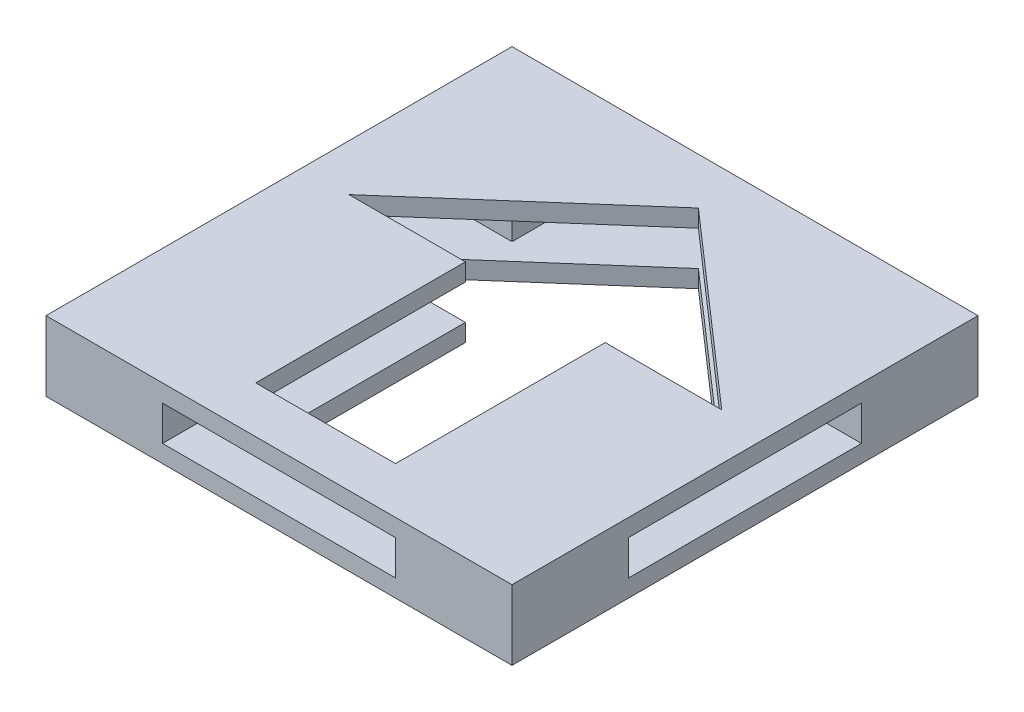
ISO-10303-21;
HEADER;
FILE_DESCRIPTION(('STEP AP214'),'2;1');
FILE_NAME('part.step','',(''),(''),'','','');
FILE_SCHEMA(('AUTOMOTIVE_DESIGN { 1 0 10303 214 1 1 1 1 }'));
ENDSEC;
DATA;
#1=APPLICATION_CONTEXT('core data for automotive mechanical design processes');
#2=APPLICATION_PROTOCOL_DEFINITION('international standard','automotive_design',2000,#1);
#3=PRODUCT_CONTEXT('',#1,'mechanical');
#4=PRODUCT('Part','Part','',(#3));
#5=PRODUCT_RELATED_PRODUCT_CATEGORY('part','',(#4));
#6=PRODUCT_DEFINITION_FORMATION('','',#4);
#7=PRODUCT_DEFINITION_CONTEXT('part definition',#1,'design');
#8=PRODUCT_DEFINITION('design','',#6,#7);
#9=PRODUCT_DEFINITION_SHAPE('','',#8);
#10=(LENGTH_UNIT() NAMED_UNIT(*) SI_UNIT(.MILLI.,.METRE.));
#11=(NAMED_UNIT(*) PLANE_ANGLE_UNIT() SI_UNIT($,.RADIAN.));
#12=(NAMED_UNIT(*) SI_UNIT($,.STERADIAN.) SOLID_ANGLE_UNIT());
#13=UNCERTAINTY_MEASURE_WITH_UNIT(LENGTH_MEASURE(1.E-05),#10,'distance_accuracy_value','');
#14=(GEOMETRIC_REPRESENTATION_CONTEXT(3) GLOBAL_UNCERTAINTY_ASSIGNED_CONTEXT((#13)) GLOBAL_UNIT_ASSIGNED_CONTEXT((#10,
#11,#12)) REPRESENTATION_CONTEXT('',''));
#15=CARTESIAN_POINT('',(0.,0.,0.));
#16=DIRECTION('',(0.,0.,1.));
#17=DIRECTION('',(1.,0.,0.));
#18=AXIS2_PLACEMENT_3D('',#15,#16,#17);
#19=CARTESIAN_POINT('',(3.,3.,-0.999999999999998));
#20=DIRECTION('',(0.,0.,-1.));
#21=DIRECTION('',(-1.,0.,0.));
#22=AXIS2_PLACEMENT_3D('',#19,#20,#21);
#23=PLANE('',#22);
#24=DIRECTION('',(0.,-1.,0.));
#25=VECTOR('',#24,1.);
#26=CARTESIAN_POINT('',(8.,3.,-0.999999999999998));
#27=LINE('',#26,#25);
#28=CARTESIAN_POINT('',(8.,3.,-0.999999999999998));
#29=VERTEX_POINT('',#28);
#30=CARTESIAN_POINT('',(8.,2.25,-0.999999999999998));
#31=VERTEX_POINT('',#30);
#32=EDGE_CURVE('E466',#29,#31,#27,.T.);
#33=ORIENTED_EDGE('',*,*,#32,.T.);
#34=DIRECTION('',(1.,0.,0.));
#35=VECTOR('',#34,1.);
#36=CARTESIAN_POINT('',(3.,2.25,-0.999999999999998));
#37=LINE('',#36,#35);
#38=CARTESIAN_POINT('',(3.,2.25,-0.999999999999999));
#39=VERTEX_POINT('',#38);
#40=EDGE_CURVE('E380',#39,#31,#37,.T.);
#41=ORIENTED_EDGE('',*,*,#40,.F.);
#42=DIRECTION('',(0.,-1.,0.));
#43=VECTOR('',#42,1.);
#44=CARTESIAN_POINT('',(3.,3.,-0.999999999999998));
#45=LINE('',#44,#43);
#46=CARTESIAN_POINT('',(3.,3.,-0.999999999999998));
#47=VERTEX_POINT('',#46);
#48=EDGE_CURVE('E471',#47,#39,#45,.T.);
#49=ORIENTED_EDGE('',*,*,#48,.F.);
#50=DIRECTION('',(1.,0.,0.));
#51=VECTOR('',#50,1.);
#52=CARTESIAN_POINT('',(3.,3.,-0.999999999999998));
#53=LINE('',#52,#51);
#54=EDGE_CURVE('E394',#47,#29,#53,.T.);
#55=ORIENTED_EDGE('',*,*,#54,.T.);
#56=EDGE_LOOP('',(#33,#41,#49,#55));
#57=FACE_BOUND('',#56,.T.);
#58=ADVANCED_FACE('F39',(#57),#23,.T.);
#59=CARTESIAN_POINT('',(8.,3.,-0.999999999999998));
#60=DIRECTION('',(-0.658504607868518,0.,0.752576694706878));
#61=DIRECTION('',(0.752576694706878,0.,0.658504607868518));
#62=AXIS2_PLACEMENT_3D('',#59,#60,#61);
#63=PLANE('',#62);
#64=DIRECTION('',(-0.752576694706878,0.,-0.658504607868518));
#65=VECTOR('',#64,1.);
#66=CARTESIAN_POINT('',(8.,2.25,-0.999999999999998));
#67=LINE('',#66,#65);
#68=CARTESIAN_POINT('',(0.,2.25,-8.));
#69=VERTEX_POINT('',#68);
#70=EDGE_CURVE('E387',#31,#69,#67,.T.);
#71=ORIENTED_EDGE('',*,*,#70,.F.);
#72=ORIENTED_EDGE('',*,*,#32,.F.);
#73=DIRECTION('',(-0.752576694706878,0.,-0.658504607868518));
#74=VECTOR('',#73,1.);
#75=CARTESIAN_POINT('',(8.,3.,-0.999999999999998));
#76=LINE('',#75,#74);
#77=CARTESIAN_POINT('',(0.,3.,-8.));
#78=VERTEX_POINT('',#77);
#79=EDGE_CURVE('E398',#29,#78,#76,.T.);
#80=ORIENTED_EDGE('',*,*,#79,.T.);
#81=DIRECTION('',(0.,-1.,0.));
#82=VECTOR('',#81,1.);
#83=CARTESIAN_POINT('',(0.,3.,-8.));
#84=LINE('',#83,#82);
#85=EDGE_CURVE('E461',#78,#69,#84,.T.);
#86=ORIENTED_EDGE('',*,*,#85,.T.);
#87=EDGE_LOOP('',(#71,#72,#80,#86));
#88=FACE_BOUND('',#87,.T.);
#89=ADVANCED_FACE('F598',(#88),#63,.T.);
#90=CARTESIAN_POINT('',(0.,3.,-8.));
#91=DIRECTION('',(0.658504607868518,0.,0.752576694706878));
#92=DIRECTION('',(0.752576694706878,0.,-0.658504607868518));
#93=AXIS2_PLACEMENT_3D('',#90,#91,#92);
#94=PLANE('',#93);
#95=DIRECTION('',(0.,-1.,0.));
#96=VECTOR('',#95,1.);
#97=CARTESIAN_POINT('',(-8.,3.,-0.999999999999998));
#98=LINE('',#97,#96);
#99=CARTESIAN_POINT('',(-8.,3.,-0.999999999999998));
#100=VERTEX_POINT('',#99);
#101=CARTESIAN_POINT('',(-8.,2.25,-1.));
#102=VERTEX_POINT('',#101);
#103=EDGE_CURVE('E456',#100,#102,#98,.T.);
#104=ORIENTED_EDGE('',*,*,#103,.T.);
#105=DIRECTION('',(-0.752576694706878,0.,0.658504607868518));
#106=VECTOR('',#105,1.);
#107=CARTESIAN_POINT('',(0.,2.25,-8.));
#108=LINE('',#107,#106);
#109=EDGE_CURVE('E383',#69,#102,#108,.T.);
#110=ORIENTED_EDGE('',*,*,#109,.F.);
#111=ORIENTED_EDGE('',*,*,#85,.F.);
#112=DIRECTION('',(-0.752576694706878,0.,0.658504607868518));
#113=VECTOR('',#112,1.);
#114=CARTESIAN_POINT('',(0.,3.,-8.));
#115=LINE('',#114,#113);
#116=EDGE_CURVE('E401',#78,#100,#115,.T.);
#117=ORIENTED_EDGE('',*,*,#116,.T.);
#118=EDGE_LOOP('',(#104,#110,#111,#117));
#119=FACE_BOUND('',#118,.T.);
#120=ADVANCED_FACE('F604',(#119),#94,.T.);
#121=CARTESIAN_POINT('',(-8.,3.,-0.999999999999998));
#122=DIRECTION('',(0.,0.,-1.));
#123=DIRECTION('',(-1.,0.,0.));
#124=AXIS2_PLACEMENT_3D('',#121,#122,#123);
#125=PLANE('',#124);
#126=DIRECTION('',(1.,0.,0.));
#127=VECTOR('',#126,1.);
#128=CARTESIAN_POINT('',(-8.,2.25,-0.999999999999998));
#129=LINE('',#128,#127);
#130=CARTESIAN_POINT('',(-3.,2.25,-0.999999999999997));
#131=VERTEX_POINT('',#130);
#132=EDGE_CURVE('E374',#102,#131,#129,.T.);
#133=ORIENTED_EDGE('',*,*,#132,.F.);
#134=ORIENTED_EDGE('',*,*,#103,.F.);
#135=DIRECTION('',(1.,0.,0.));
#136=VECTOR('',#135,1.);
#137=CARTESIAN_POINT('',(-8.,3.,-0.999999999999998));
#138=LINE('',#137,#136);
#139=CARTESIAN_POINT('',(-3.,3.,-0.999999999999998));
#140=VERTEX_POINT('',#139);
#141=EDGE_CURVE('E404',#100,#140,#138,.T.);
#142=ORIENTED_EDGE('',*,*,#141,.T.);
#143=DIRECTION('',(0.,-1.,0.));
#144=VECTOR('',#143,1.);
#145=CARTESIAN_POINT('',(-3.,3.,-0.999999999999998));
#146=LINE('',#145,#144);
#147=EDGE_CURVE('E451',#140,#131,#146,.T.);
#148=ORIENTED_EDGE('',*,*,#147,.T.);
#149=EDGE_LOOP('',(#133,#134,#142,#148));
#150=FACE_BOUND('',#149,.T.);
#151=ADVANCED_FACE('F665',(#150),#125,.T.);
#152=CARTESIAN_POINT('',(3.,3.,8.));
#153=DIRECTION('',(-1.,0.,0.));
#154=DIRECTION('',(0.,0.,1.));
#155=AXIS2_PLACEMENT_3D('',#152,#153,#154);
#156=PLANE('',#155);
#157=DIRECTION('',(0.,0.,-1.));
#158=VECTOR('',#157,1.);
#159=CARTESIAN_POINT('',(3.,2.25,8.));
#160=LINE('',#159,#158);
#161=CARTESIAN_POINT('',(3.,2.25,8.));
#162=VERTEX_POINT('',#161);
#163=EDGE_CURVE('E377',#162,#39,#160,.T.);
#164=ORIENTED_EDGE('',*,*,#163,.F.);
#165=DIRECTION('',(0.,-1.,0.));
#166=VECTOR('',#165,1.);
#167=CARTESIAN_POINT('',(3.,3.,8.));
#168=LINE('',#167,#166);
#169=CARTESIAN_POINT('',(3.,3.,8.));
#170=VERTEX_POINT('',#169);
#171=EDGE_CURVE('E441',#170,#162,#168,.T.);
#172=ORIENTED_EDGE('',*,*,#171,.F.);
#173=DIRECTION('',(0.,0.,-1.));
#174=VECTOR('',#173,1.);
#175=CARTESIAN_POINT('',(3.,3.,8.));
#176=LINE('',#175,#174);
#177=EDGE_CURVE('E391',#170,#47,#176,.T.);
#178=ORIENTED_EDGE('',*,*,#177,.T.);
#179=ORIENTED_EDGE('',*,*,#48,.T.);
#180=EDGE_LOOP('',(#164,#172,#178,#179));
#181=FACE_BOUND('',#180,.T.);
#182=ADVANCED_FACE('F616',(#181),#156,.T.);
#183=CARTESIAN_POINT('',(-3.,3.,8.));
#184=DIRECTION('',(1.,0.,0.));
#185=DIRECTION('',(0.,0.,-1.));
#186=AXIS2_PLACEMENT_3D('',#183,#184,#185);
#187=PLANE('',#186);
#188=DIRECTION('',(0.,0.,1.));
#189=VECTOR('',#188,1.);
#190=CARTESIAN_POINT('',(-3.,2.25,8.));
#191=LINE('',#190,#189);
#192=CARTESIAN_POINT('',(-3.,2.25,8.));
#193=VERTEX_POINT('',#192);
#194=EDGE_CURVE('E371',#131,#193,#191,.T.);
#195=ORIENTED_EDGE('',*,*,#194,.F.);
#196=ORIENTED_EDGE('',*,*,#147,.F.);
#197=DIRECTION('',(0.,0.,1.));
#198=VECTOR('',#197,1.);
#199=CARTESIAN_POINT('',(-3.,3.,8.));
#200=LINE('',#199,#198);
#201=CARTESIAN_POINT('',(-3.,3.,8.));
#202=VERTEX_POINT('',#201);
#203=EDGE_CURVE('E407',#140,#202,#200,.T.);
#204=ORIENTED_EDGE('',*,*,#203,.T.);
#205=DIRECTION('',(0.,-1.,0.));
#206=VECTOR('',#205,1.);
#207=CARTESIAN_POINT('',(-3.,3.,8.));
#208=LINE('',#207,#206);
#209=EDGE_CURVE('E446',#202,#193,#208,.T.);
#210=ORIENTED_EDGE('',*,*,#209,.T.);
#211=EDGE_LOOP('',(#195,#196,#204,#210));
#212=FACE_BOUND('',#211,.T.);
#213=ADVANCED_FACE('F651',(#212),#187,.T.);
#214=CARTESIAN_POINT('',(3.,3.,8.));
#215=DIRECTION('',(0.,0.,-1.));
#216=DIRECTION('',(-1.,0.,0.));
#217=AXIS2_PLACEMENT_3D('',#214,#215,#216);
#218=PLANE('',#217);
#219=DIRECTION('',(1.,0.,0.));
#220=VECTOR('',#219,1.);
#221=CARTESIAN_POINT('',(3.,2.25,8.));
#222=LINE('',#221,#220);
#223=EDGE_CURVE('E520',#193,#162,#222,.T.);
#224=ORIENTED_EDGE('',*,*,#223,.F.);
#225=ORIENTED_EDGE('',*,*,#209,.F.);
#226=DIRECTION('',(1.,0.,0.));
#227=VECTOR('',#226,1.);
#228=CARTESIAN_POINT('',(3.,3.,8.));
#229=LINE('',#228,#227);
#230=EDGE_CURVE('E411',#202,#170,#229,.T.);
#231=ORIENTED_EDGE('',*,*,#230,.T.);
#232=ORIENTED_EDGE('',*,*,#171,.T.);
#233=EDGE_LOOP('',(#224,#225,#231,#232));
#234=FACE_BOUND('',#233,.T.);
#235=ADVANCED_FACE('F620',(#234),#218,.T.);
#236=CARTESIAN_POINT('',(0.,3.,0.));
#237=DIRECTION('',(0.,1.,0.));
#238=DIRECTION('',(0.,0.,1.));
#239=AXIS2_PLACEMENT_3D('',#236,#237,#238);
#240=PLANE('',#239);
#241=DIRECTION('',(0.,0.,-1.));
#242=VECTOR('',#241,1.);
#243=CARTESIAN_POINT('',(10.,3.,-10.));
#244=LINE('',#243,#242);
#245=CARTESIAN_POINT('',(10.,3.,10.));
#246=VERTEX_POINT('',#245);
#247=CARTESIAN_POINT('',(10.,3.,-10.));
#248=VERTEX_POINT('',#247);
#249=EDGE_CURVE('E476',#246,#248,#244,.T.);
#250=ORIENTED_EDGE('',*,*,#249,.T.);
#251=DIRECTION('',(-1.,0.,0.));
#252=VECTOR('',#251,1.);
#253=CARTESIAN_POINT('',(-10.,3.,-10.));
#254=LINE('',#253,#252);
#255=CARTESIAN_POINT('',(-10.,3.,-10.));
#256=VERTEX_POINT('',#255);
#257=EDGE_CURVE('E480',#248,#256,#254,.T.);
#258=ORIENTED_EDGE('',*,*,#257,.T.);
#259=DIRECTION('',(0.,0.,1.));
#260=VECTOR('',#259,1.);
#261=CARTESIAN_POINT('',(-10.,3.,-10.));
#262=LINE('',#261,#260);
#263=CARTESIAN_POINT('',(-10.,3.,10.));
#264=VERTEX_POINT('',#263);
#265=EDGE_CURVE('E484',#256,#264,#262,.T.);
#266=ORIENTED_EDGE('',*,*,#265,.T.);
#267=DIRECTION('',(1.,0.,0.));
#268=VECTOR('',#267,1.);
#269=CARTESIAN_POINT('',(-10.,3.,10.));
#270=LINE('',#269,#268);
#271=EDGE_CURVE('E487',#264,#246,#270,.T.);
#272=ORIENTED_EDGE('',*,*,#271,.T.);
#273=EDGE_LOOP('',(#250,#258,#266,#272));
#274=FACE_BOUND('',#273,.T.);
#275=ORIENTED_EDGE('',*,*,#54,.F.);
#276=ORIENTED_EDGE('',*,*,#177,.F.);
#277=ORIENTED_EDGE('',*,*,#230,.F.);
#278=ORIENTED_EDGE('',*,*,#203,.F.);
#279=ORIENTED_EDGE('',*,*,#141,.F.);
#280=ORIENTED_EDGE('',*,*,#116,.F.);
#281=ORIENTED_EDGE('',*,*,#79,.F.);
#282=EDGE_LOOP('',(#275,#276,#277,#278,#279,#280,#281));
#283=FACE_BOUND('',#282,.T.);
#284=ADVANCED_FACE('F617',(#274,#283),#240,.T.);
#285=CARTESIAN_POINT('',(0.,0.,0.));
#286=DIRECTION('',(0.,1.,0.));
#287=DIRECTION('',(0.,0.,1.));
#288=AXIS2_PLACEMENT_3D('',#285,#286,#287);
#289=PLANE('',#288);
#290=DIRECTION('',(0.,0.,-1.));
#291=VECTOR('',#290,1.);
#292=CARTESIAN_POINT('',(10.,0.,-10.));
#293=LINE('',#292,#291);
#294=CARTESIAN_POINT('',(10.,0.,10.));
#295=VERTEX_POINT('',#294);
#296=CARTESIAN_POINT('',(10.,0.,-10.));
#297=VERTEX_POINT('',#296);
#298=EDGE_CURVE('E475',#295,#297,#293,.T.);
#299=ORIENTED_EDGE('',*,*,#298,.F.);
#300=DIRECTION('',(1.,0.,0.));
#301=VECTOR('',#300,1.);
#302=CARTESIAN_POINT('',(-10.,0.,10.));
#303=LINE('',#302,#301);
#304=CARTESIAN_POINT('',(-10.,0.,10.));
#305=VERTEX_POINT('',#304);
#306=EDGE_CURVE('E481',#305,#295,#303,.T.);
#307=ORIENTED_EDGE('',*,*,#306,.F.);
#308=DIRECTION('',(0.,0.,1.));
#309=VECTOR('',#308,1.);
#310=CARTESIAN_POINT('',(-10.,0.,-10.));
#311=LINE('',#310,#309);
#312=CARTESIAN_POINT('',(-10.,0.,-10.));
#313=VERTEX_POINT('',#312);
#314=EDGE_CURVE('E497',#313,#305,#311,.T.);
#315=ORIENTED_EDGE('',*,*,#314,.F.);
#316=DIRECTION('',(-1.,0.,0.));
#317=VECTOR('',#316,1.);
#318=CARTESIAN_POINT('',(-10.,0.,-10.));
#319=LINE('',#318,#317);
#320=EDGE_CURVE('E494',#297,#313,#319,.T.);
#321=ORIENTED_EDGE('',*,*,#320,.F.);
#322=EDGE_LOOP('',(#299,#307,#315,#321));
#323=FACE_BOUND('',#322,.T.);
#324=DIRECTION('',(0.,0.,-1.));
#325=VECTOR('',#324,1.);
#326=CARTESIAN_POINT('',(3.,0.,8.));
#327=LINE('',#326,#325);
#328=CARTESIAN_POINT('',(3.,0.,8.));
#329=VERTEX_POINT('',#328);
#330=CARTESIAN_POINT('',(3.,0.,-0.999999999999998));
#331=VERTEX_POINT('',#330);
#332=EDGE_CURVE('E390',#329,#331,#327,.T.);
#333=ORIENTED_EDGE('',*,*,#332,.T.);
#334=DIRECTION('',(1.,0.,0.));
#335=VECTOR('',#334,1.);
#336=CARTESIAN_POINT('',(3.,0.,-0.999999999999998));
#337=LINE('',#336,#335);
#338=CARTESIAN_POINT('',(8.,0.,-0.999999999999998));
#339=VERTEX_POINT('',#338);
#340=EDGE_CURVE('E418',#331,#339,#337,.T.);
#341=ORIENTED_EDGE('',*,*,#340,.T.);
#342=DIRECTION('',(-0.752576694706878,0.,-0.658504607868518));
#343=VECTOR('',#342,1.);
#344=CARTESIAN_POINT('',(8.,0.,-0.999999999999998));
#345=LINE('',#344,#343);
#346=CARTESIAN_POINT('',(0.,0.,-8.));
#347=VERTEX_POINT('',#346);
#348=EDGE_CURVE('E422',#339,#347,#345,.T.);
#349=ORIENTED_EDGE('',*,*,#348,.T.);
#350=DIRECTION('',(-0.752576694706878,0.,0.658504607868518));
#351=VECTOR('',#350,1.);
#352=CARTESIAN_POINT('',(0.,0.,-8.));
#353=LINE('',#352,#351);
#354=CARTESIAN_POINT('',(-8.,0.,-0.999999999999998));
#355=VERTEX_POINT('',#354);
#356=EDGE_CURVE('E426',#347,#355,#353,.T.);
#357=ORIENTED_EDGE('',*,*,#356,.T.);
#358=DIRECTION('',(1.,0.,0.));
#359=VECTOR('',#358,1.);
#360=CARTESIAN_POINT('',(-8.,0.,-0.999999999999998));
#361=LINE('',#360,#359);
#362=CARTESIAN_POINT('',(-3.,0.,-0.999999999999998));
#363=VERTEX_POINT('',#362);
#364=EDGE_CURVE('E430',#355,#363,#361,.T.);
#365=ORIENTED_EDGE('',*,*,#364,.T.);
#366=DIRECTION('',(0.,0.,1.));
#367=VECTOR('',#366,1.);
#368=CARTESIAN_POINT('',(-3.,0.,8.));
#369=LINE('',#368,#367);
#370=CARTESIAN_POINT('',(-3.,0.,8.));
#371=VERTEX_POINT('',#370);
#372=EDGE_CURVE('E434',#363,#371,#369,.T.);
#373=ORIENTED_EDGE('',*,*,#372,.T.);
#374=DIRECTION('',(1.,0.,0.));
#375=VECTOR('',#374,1.);
#376=CARTESIAN_POINT('',(3.,0.,8.));
#377=LINE('',#376,#375);
#378=EDGE_CURVE('E395',#371,#329,#377,.T.);
#379=ORIENTED_EDGE('',*,*,#378,.T.);
#380=EDGE_LOOP('',(#333,#341,#349,#357,#365,#373,#379));
#381=FACE_BOUND('',#380,.T.);
#382=ADVANCED_FACE('F571',(#323,#381),#289,.F.);
#383=CARTESIAN_POINT('',(10.,3.,-10.));
#384=DIRECTION('',(-1.,0.,0.));
#385=DIRECTION('',(0.,0.,1.));
#386=AXIS2_PLACEMENT_3D('',#383,#384,#385);
#387=PLANE('',#386);
#388=DIRECTION('',(0.,0.,-1.));
#389=VECTOR('',#388,1.);
#390=CARTESIAN_POINT('',(10.,0.750000000000002,-5.));
#391=LINE('',#390,#389);
#392=CARTESIAN_POINT('',(10.,0.750000000000001,5.));
#393=VERTEX_POINT('',#392);
#394=CARTESIAN_POINT('',(10.,0.750000000000002,-5.));
#395=VERTEX_POINT('',#394);
#396=EDGE_CURVE('E277',#393,#395,#391,.T.);
#397=ORIENTED_EDGE('',*,*,#396,.F.);
#398=DIRECTION('',(0.,-1.,0.));
#399=VECTOR('',#398,1.);
#400=CARTESIAN_POINT('',(10.,0.750000000000001,5.));
#401=LINE('',#400,#399);
#402=CARTESIAN_POINT('',(10.,2.25,5.));
#403=VERTEX_POINT('',#402);
#404=EDGE_CURVE('E55',#403,#393,#401,.T.);
#405=ORIENTED_EDGE('',*,*,#404,.F.);
#406=DIRECTION('',(0.,0.,1.));
#407=VECTOR('',#406,1.);
#408=CARTESIAN_POINT('',(10.,2.25,-5.));
#409=LINE('',#408,#407);
#410=CARTESIAN_POINT('',(10.,2.25,-5.));
#411=VERTEX_POINT('',#410);
#412=EDGE_CURVE('E264',#411,#403,#409,.T.);
#413=ORIENTED_EDGE('',*,*,#412,.F.);
#414=DIRECTION('',(0.,1.,0.));
#415=VECTOR('',#414,1.);
#416=CARTESIAN_POINT('',(10.,0.750000000000002,-5.));
#417=LINE('',#416,#415);
#418=EDGE_CURVE('E268',#395,#411,#417,.T.);
#419=ORIENTED_EDGE('',*,*,#418,.F.);
#420=EDGE_LOOP('',(#397,#405,#413,#419));
#421=FACE_BOUND('',#420,.T.);
#422=ORIENTED_EDGE('',*,*,#298,.T.);
#423=DIRECTION('',(0.,-1.,0.));
#424=VECTOR('',#423,1.);
#425=CARTESIAN_POINT('',(10.,3.,-10.));
#426=LINE('',#425,#424);
#427=EDGE_CURVE('E513',#248,#297,#426,.T.);
#428=ORIENTED_EDGE('',*,*,#427,.F.);
#429=ORIENTED_EDGE('',*,*,#249,.F.);
#430=DIRECTION('',(0.,-1.,0.));
#431=VECTOR('',#430,1.);
#432=CARTESIAN_POINT('',(10.,3.,10.));
#433=LINE('',#432,#431);
#434=EDGE_CURVE('E490',#246,#295,#433,.T.);
#435=ORIENTED_EDGE('',*,*,#434,.T.);
#436=EDGE_LOOP('',(#422,#428,#429,#435));
#437=FACE_BOUND('',#436,.T.);
#438=ADVANCED_FACE('F41',(#421,#437),#387,.F.);
#439=CARTESIAN_POINT('',(-10.,3.,-10.));
#440=DIRECTION('',(0.,0.,1.));
#441=DIRECTION('',(1.,0.,0.));
#442=AXIS2_PLACEMENT_3D('',#439,#440,#441);
#443=PLANE('',#442);
#444=DIRECTION('',(-1.,0.,0.));
#445=VECTOR('',#444,1.);
#446=CARTESIAN_POINT('',(5.,2.25,-10.));
#447=LINE('',#446,#445);
#448=CARTESIAN_POINT('',(5.,2.25,-10.));
#449=VERTEX_POINT('',#448);
#450=CARTESIAN_POINT('',(-5.,2.25,-10.));
#451=VERTEX_POINT('',#450);
#452=EDGE_CURVE('E315',#449,#451,#447,.T.);
#453=ORIENTED_EDGE('',*,*,#452,.T.);
#454=DIRECTION('',(0.,-1.,0.));
#455=VECTOR('',#454,1.);
#456=CARTESIAN_POINT('',(-5.,0.750000000000001,-10.));
#457=LINE('',#456,#455);
#458=CARTESIAN_POINT('',(-5.,0.750000000000001,-10.));
#459=VERTEX_POINT('',#458);
#460=EDGE_CURVE('E302',#451,#459,#457,.T.);
#461=ORIENTED_EDGE('',*,*,#460,.T.);
#462=DIRECTION('',(1.,0.,0.));
#463=VECTOR('',#462,1.);
#464=CARTESIAN_POINT('',(5.,0.750000000000002,-10.));
#465=LINE('',#464,#463);
#466=CARTESIAN_POINT('',(5.,0.750000000000002,-10.));
#467=VERTEX_POINT('',#466);
#468=EDGE_CURVE('E306',#459,#467,#465,.T.);
#469=ORIENTED_EDGE('',*,*,#468,.T.);
#470=DIRECTION('',(0.,1.,0.));
#471=VECTOR('',#470,1.);
#472=CARTESIAN_POINT('',(5.,0.750000000000002,-10.));
#473=LINE('',#472,#471);
#474=EDGE_CURVE('E311',#467,#449,#473,.T.);
#475=ORIENTED_EDGE('',*,*,#474,.T.);
#476=EDGE_LOOP('',(#453,#461,#469,#475));
#477=FACE_BOUND('',#476,.T.);
#478=ORIENTED_EDGE('',*,*,#320,.T.);
#479=DIRECTION('',(0.,-1.,0.));
#480=VECTOR('',#479,1.);
#481=CARTESIAN_POINT('',(-10.,3.,-10.));
#482=LINE('',#481,#480);
#483=EDGE_CURVE('E509',#256,#313,#482,.T.);
#484=ORIENTED_EDGE('',*,*,#483,.F.);
#485=ORIENTED_EDGE('',*,*,#257,.F.);
#486=ORIENTED_EDGE('',*,*,#427,.T.);
#487=EDGE_LOOP('',(#478,#484,#485,#486));
#488=FACE_BOUND('',#487,.T.);
#489=ADVANCED_FACE('F534',(#477,#488),#443,.F.);
#490=CARTESIAN_POINT('',(-10.,3.,-10.));
#491=DIRECTION('',(1.,0.,0.));
#492=DIRECTION('',(0.,0.,-1.));
#493=AXIS2_PLACEMENT_3D('',#490,#491,#492);
#494=PLANE('',#493);
#495=DIRECTION('',(0.,0.,1.));
#496=VECTOR('',#495,1.);
#497=CARTESIAN_POINT('',(-10.,2.25,-5.));
#498=LINE('',#497,#496);
#499=CARTESIAN_POINT('',(-10.,2.25,-5.));
#500=VERTEX_POINT('',#499);
#501=CARTESIAN_POINT('',(-10.,2.25,5.));
#502=VERTEX_POINT('',#501);
#503=EDGE_CURVE('E262',#500,#502,#498,.T.);
#504=ORIENTED_EDGE('',*,*,#503,.T.);
#505=DIRECTION('',(0.,-1.,0.));
#506=VECTOR('',#505,1.);
#507=CARTESIAN_POINT('',(-10.,0.750000000000001,5.));
#508=LINE('',#507,#506);
#509=CARTESIAN_POINT('',(-10.,0.750000000000001,5.));
#510=VERTEX_POINT('',#509);
#511=EDGE_CURVE('E241',#502,#510,#508,.T.);
#512=ORIENTED_EDGE('',*,*,#511,.T.);
#513=DIRECTION('',(0.,0.,-1.));
#514=VECTOR('',#513,1.);
#515=CARTESIAN_POINT('',(-10.,0.750000000000002,-5.));
#516=LINE('',#515,#514);
#517=CARTESIAN_POINT('',(-10.,0.750000000000002,-5.));
#518=VERTEX_POINT('',#517);
#519=EDGE_CURVE('E252',#510,#518,#516,.T.);
#520=ORIENTED_EDGE('',*,*,#519,.T.);
#521=DIRECTION('',(0.,1.,0.));
#522=VECTOR('',#521,1.);
#523=CARTESIAN_POINT('',(-10.,0.750000000000002,-5.));
#524=LINE('',#523,#522);
#525=EDGE_CURVE('E63',#518,#500,#524,.T.);
#526=ORIENTED_EDGE('',*,*,#525,.T.);
#527=EDGE_LOOP('',(#504,#512,#520,#526));
#528=FACE_BOUND('',#527,.T.);
#529=ORIENTED_EDGE('',*,*,#314,.T.);
#530=DIRECTION('',(0.,-1.,0.));
#531=VECTOR('',#530,1.);
#532=CARTESIAN_POINT('',(-10.,3.,10.));
#533=LINE('',#532,#531);
#534=EDGE_CURVE('E505',#264,#305,#533,.T.);
#535=ORIENTED_EDGE('',*,*,#534,.F.);
#536=ORIENTED_EDGE('',*,*,#265,.F.);
#537=ORIENTED_EDGE('',*,*,#483,.T.);
#538=EDGE_LOOP('',(#529,#535,#536,#537));
#539=FACE_BOUND('',#538,.T.);
#540=ADVANCED_FACE('F259',(#528,#539),#494,.F.);
#541=CARTESIAN_POINT('',(-10.,3.,10.));
#542=DIRECTION('',(0.,0.,-1.));
#543=DIRECTION('',(-1.,0.,0.));
#544=AXIS2_PLACEMENT_3D('',#541,#542,#543);
#545=PLANE('',#544);
#546=DIRECTION('',(1.,0.,0.));
#547=VECTOR('',#546,1.);
#548=CARTESIAN_POINT('',(5.,0.750000000000002,10.));
#549=LINE('',#548,#547);
#550=CARTESIAN_POINT('',(-5.,0.750000000000001,10.));
#551=VERTEX_POINT('',#550);
#552=CARTESIAN_POINT('',(5.,0.750000000000002,10.));
#553=VERTEX_POINT('',#552);
#554=EDGE_CURVE('E323',#551,#553,#549,.T.);
#555=ORIENTED_EDGE('',*,*,#554,.F.);
#556=DIRECTION('',(0.,-1.,0.));
#557=VECTOR('',#556,1.);
#558=CARTESIAN_POINT('',(-5.,0.750000000000001,10.));
#559=LINE('',#558,#557);
#560=CARTESIAN_POINT('',(-5.,2.25,10.));
#561=VERTEX_POINT('',#560);
#562=EDGE_CURVE('E301',#561,#551,#559,.T.);
#563=ORIENTED_EDGE('',*,*,#562,.F.);
#564=DIRECTION('',(-1.,0.,0.));
#565=VECTOR('',#564,1.);
#566=CARTESIAN_POINT('',(5.,2.25,10.));
#567=LINE('',#566,#565);
#568=CARTESIAN_POINT('',(5.,2.25,10.));
#569=VERTEX_POINT('',#568);
#570=EDGE_CURVE('E307',#569,#561,#567,.T.);
#571=ORIENTED_EDGE('',*,*,#570,.F.);
#572=DIRECTION('',(0.,1.,0.));
#573=VECTOR('',#572,1.);
#574=CARTESIAN_POINT('',(5.,0.750000000000002,10.));
#575=LINE('',#574,#573);
#576=EDGE_CURVE('E327',#553,#569,#575,.T.);
#577=ORIENTED_EDGE('',*,*,#576,.F.);
#578=EDGE_LOOP('',(#555,#563,#571,#577));
#579=FACE_BOUND('',#578,.T.);
#580=ORIENTED_EDGE('',*,*,#306,.T.);
#581=ORIENTED_EDGE('',*,*,#434,.F.);
#582=ORIENTED_EDGE('',*,*,#271,.F.);
#583=ORIENTED_EDGE('',*,*,#534,.T.);
#584=EDGE_LOOP('',(#580,#581,#582,#583));
#585=FACE_BOUND('',#584,.T.);
#586=ADVANCED_FACE('F615',(#579,#585),#545,.F.);
#587=DIRECTION('',(0.,0.,1.));
#588=VECTOR('',#587,1.);
#589=CARTESIAN_POINT('',(3.,0.750000000000002,8.));
#590=LINE('',#589,#588);
#591=CARTESIAN_POINT('',(3.,0.750000000000002,-0.999999999999999));
#592=VERTEX_POINT('',#591);
#593=CARTESIAN_POINT('',(3.,0.750000000000001,8.));
#594=VERTEX_POINT('',#593);
#595=EDGE_CURVE('E358',#592,#594,#590,.T.);
#596=ORIENTED_EDGE('',*,*,#595,.F.);
#597=EDGE_CURVE('E470',#592,#331,#45,.T.);
#598=ORIENTED_EDGE('',*,*,#597,.T.);
#599=ORIENTED_EDGE('',*,*,#332,.F.);
#600=EDGE_CURVE('E414',#594,#329,#168,.T.);
#601=ORIENTED_EDGE('',*,*,#600,.F.);
#602=EDGE_LOOP('',(#596,#598,#599,#601));
#603=FACE_BOUND('',#602,.T.);
#604=ADVANCED_FACE('F564',(#603),#156,.T.);
#605=DIRECTION('',(-1.,0.,0.));
#606=VECTOR('',#605,1.);
#607=CARTESIAN_POINT('',(3.,0.750000000000002,-0.999999999999998));
#608=LINE('',#607,#606);
#609=CARTESIAN_POINT('',(8.,0.750000000000002,-0.999999999999999));
#610=VERTEX_POINT('',#609);
#611=EDGE_CURVE('E361',#610,#592,#608,.T.);
#612=ORIENTED_EDGE('',*,*,#611,.F.);
#613=EDGE_CURVE('E465',#610,#339,#27,.T.);
#614=ORIENTED_EDGE('',*,*,#613,.T.);
#615=ORIENTED_EDGE('',*,*,#340,.F.);
#616=ORIENTED_EDGE('',*,*,#597,.F.);
#617=EDGE_LOOP('',(#612,#614,#615,#616));
#618=FACE_BOUND('',#617,.T.);
#619=ADVANCED_FACE('F567',(#618),#23,.T.);
#620=ORIENTED_EDGE('',*,*,#613,.F.);
#621=DIRECTION('',(0.752576694706878,0.,0.658504607868518));
#622=VECTOR('',#621,1.);
#623=CARTESIAN_POINT('',(8.,0.750000000000002,-0.999999999999998));
#624=LINE('',#623,#622);
#625=CARTESIAN_POINT('',(0.,0.750000000000002,-8.));
#626=VERTEX_POINT('',#625);
#627=EDGE_CURVE('E367',#626,#610,#624,.T.);
#628=ORIENTED_EDGE('',*,*,#627,.F.);
#629=EDGE_CURVE('E460',#626,#347,#84,.T.);
#630=ORIENTED_EDGE('',*,*,#629,.T.);
#631=ORIENTED_EDGE('',*,*,#348,.F.);
#632=EDGE_LOOP('',(#620,#628,#630,#631));
#633=FACE_BOUND('',#632,.T.);
#634=ADVANCED_FACE('F595',(#633),#63,.T.);
#635=DIRECTION('',(0.752576694706878,0.,-0.658504607868518));
#636=VECTOR('',#635,1.);
#637=CARTESIAN_POINT('',(0.,0.750000000000002,-8.));
#638=LINE('',#637,#636);
#639=CARTESIAN_POINT('',(-8.,0.750000000000002,-0.999999999999998));
#640=VERTEX_POINT('',#639);
#641=EDGE_CURVE('E364',#640,#626,#638,.T.);
#642=ORIENTED_EDGE('',*,*,#641,.F.);
#643=EDGE_CURVE('E455',#640,#355,#98,.T.);
#644=ORIENTED_EDGE('',*,*,#643,.T.);
#645=ORIENTED_EDGE('',*,*,#356,.F.);
#646=ORIENTED_EDGE('',*,*,#629,.F.);
#647=EDGE_LOOP('',(#642,#644,#645,#646));
#648=FACE_BOUND('',#647,.T.);
#649=ADVANCED_FACE('F592',(#648),#94,.T.);
#650=ORIENTED_EDGE('',*,*,#643,.F.);
#651=DIRECTION('',(-1.,0.,0.));
#652=VECTOR('',#651,1.);
#653=CARTESIAN_POINT('',(-8.,0.75,-0.999999999999998));
#654=LINE('',#653,#652);
#655=CARTESIAN_POINT('',(-3.,0.750000000000001,-0.999999999999997));
#656=VERTEX_POINT('',#655);
#657=EDGE_CURVE('E355',#656,#640,#654,.T.);
#658=ORIENTED_EDGE('',*,*,#657,.F.);
#659=EDGE_CURVE('E450',#656,#363,#146,.T.);
#660=ORIENTED_EDGE('',*,*,#659,.T.);
#661=ORIENTED_EDGE('',*,*,#364,.F.);
#662=EDGE_LOOP('',(#650,#658,#660,#661));
#663=FACE_BOUND('',#662,.T.);
#664=ADVANCED_FACE('F587',(#663),#125,.T.);
#665=DIRECTION('',(0.,0.,-1.));
#666=VECTOR('',#665,1.);
#667=CARTESIAN_POINT('',(-3.,0.750000000000001,8.));
#668=LINE('',#667,#666);
#669=CARTESIAN_POINT('',(-3.,0.750000000000001,8.));
#670=VERTEX_POINT('',#669);
#671=EDGE_CURVE('E338',#670,#656,#668,.T.);
#672=ORIENTED_EDGE('',*,*,#671,.F.);
#673=EDGE_CURVE('E445',#670,#371,#208,.T.);
#674=ORIENTED_EDGE('',*,*,#673,.T.);
#675=ORIENTED_EDGE('',*,*,#372,.F.);
#676=ORIENTED_EDGE('',*,*,#659,.F.);
#677=EDGE_LOOP('',(#672,#674,#675,#676));
#678=FACE_BOUND('',#677,.T.);
#679=ADVANCED_FACE('F583',(#678),#187,.T.);
#680=DIRECTION('',(-1.,0.,0.));
#681=VECTOR('',#680,1.);
#682=CARTESIAN_POINT('',(3.,0.750000000000002,8.));
#683=LINE('',#682,#681);
#684=EDGE_CURVE('E517',#594,#670,#683,.T.);
#685=ORIENTED_EDGE('',*,*,#684,.F.);
#686=ORIENTED_EDGE('',*,*,#600,.T.);
#687=ORIENTED_EDGE('',*,*,#378,.F.);
#688=ORIENTED_EDGE('',*,*,#673,.F.);
#689=EDGE_LOOP('',(#685,#686,#687,#688));
#690=FACE_BOUND('',#689,.T.);
#691=ADVANCED_FACE('F577',(#690),#218,.T.);
#692=CARTESIAN_POINT('',(-5.,0.750000000000001,-10.));
#693=DIRECTION('',(-1.,0.,0.));
#694=DIRECTION('',(0.,0.,1.));
#695=AXIS2_PLACEMENT_3D('',#692,#693,#694);
#696=PLANE('',#695);
#697=DIRECTION('',(0.,0.,1.));
#698=VECTOR('',#697,1.);
#699=CARTESIAN_POINT('',(-5.,0.750000000000001,-10.));
#700=LINE('',#699,#698);
#701=CARTESIAN_POINT('',(-5.,0.750000000000001,5.));
#702=VERTEX_POINT('',#701);
#703=EDGE_CURVE('E319',#702,#551,#700,.T.);
#704=ORIENTED_EDGE('',*,*,#703,.F.);
#705=DIRECTION('',(0.,1.,0.));
#706=VECTOR('',#705,1.);
#707=CARTESIAN_POINT('',(-5.,0.750000000000001,5.));
#708=LINE('',#707,#706);
#709=CARTESIAN_POINT('',(-5.,2.25,5.));
#710=VERTEX_POINT('',#709);
#711=EDGE_CURVE('E244',#702,#710,#708,.T.);
#712=ORIENTED_EDGE('',*,*,#711,.T.);
#713=DIRECTION('',(0.,0.,1.));
#714=VECTOR('',#713,1.);
#715=CARTESIAN_POINT('',(-5.,2.25,-10.));
#716=LINE('',#715,#714);
#717=EDGE_CURVE('E339',#710,#561,#716,.T.);
#718=ORIENTED_EDGE('',*,*,#717,.T.);
#719=ORIENTED_EDGE('',*,*,#562,.T.);
#720=EDGE_LOOP('',(#704,#712,#718,#719));
#721=FACE_BOUND('',#720,.T.);
#722=ADVANCED_FACE('F697',(#721),#696,.F.);
#723=CARTESIAN_POINT('',(5.,0.750000000000002,-10.));
#724=DIRECTION('',(1.,0.,0.));
#725=DIRECTION('',(0.,0.,-1.));
#726=AXIS2_PLACEMENT_3D('',#723,#724,#725);
#727=PLANE('',#726);
#728=DIRECTION('',(0.,0.,1.));
#729=VECTOR('',#728,1.);
#730=CARTESIAN_POINT('',(5.,2.25,-10.));
#731=LINE('',#730,#729);
#732=CARTESIAN_POINT('',(5.,2.25,5.));
#733=VERTEX_POINT('',#732);
#734=EDGE_CURVE('E344',#733,#569,#731,.T.);
#735=ORIENTED_EDGE('',*,*,#734,.F.);
#736=DIRECTION('',(0.,-1.,0.));
#737=VECTOR('',#736,1.);
#738=CARTESIAN_POINT('',(5.,0.750000000000002,5.));
#739=LINE('',#738,#737);
#740=CARTESIAN_POINT('',(5.,0.750000000000001,5.));
#741=VERTEX_POINT('',#740);
#742=EDGE_CURVE('E11',#733,#741,#739,.T.);
#743=ORIENTED_EDGE('',*,*,#742,.T.);
#744=DIRECTION('',(0.,0.,1.));
#745=VECTOR('',#744,1.);
#746=CARTESIAN_POINT('',(5.,0.750000000000002,-10.));
#747=LINE('',#746,#745);
#748=EDGE_CURVE('E349',#741,#553,#747,.T.);
#749=ORIENTED_EDGE('',*,*,#748,.T.);
#750=ORIENTED_EDGE('',*,*,#576,.T.);
#751=EDGE_LOOP('',(#735,#743,#749,#750));
#752=FACE_BOUND('',#751,.T.);
#753=ADVANCED_FACE('F758',(#752),#727,.F.);
#754=CARTESIAN_POINT('',(-5.,2.25,-5.));
#755=VERTEX_POINT('',#754);
#756=EDGE_CURVE('E334',#451,#755,#716,.T.);
#757=ORIENTED_EDGE('',*,*,#756,.T.);
#758=DIRECTION('',(0.,-1.,0.));
#759=VECTOR('',#758,1.);
#760=CARTESIAN_POINT('',(-5.,0.750000000000001,-5.));
#761=LINE('',#760,#759);
#762=CARTESIAN_POINT('',(-5.,0.750000000000002,-5.));
#763=VERTEX_POINT('',#762);
#764=EDGE_CURVE('E287',#755,#763,#761,.T.);
#765=ORIENTED_EDGE('',*,*,#764,.T.);
#766=EDGE_CURVE('E350',#459,#763,#700,.T.);
#767=ORIENTED_EDGE('',*,*,#766,.F.);
#768=ORIENTED_EDGE('',*,*,#460,.F.);
#769=EDGE_LOOP('',(#757,#765,#767,#768));
#770=FACE_BOUND('',#769,.T.);
#771=ADVANCED_FACE('F761',(#770),#696,.F.);
#772=CARTESIAN_POINT('',(5.,2.25,-10.));
#773=DIRECTION('',(0.,1.,0.));
#774=DIRECTION('',(0.,0.,1.));
#775=AXIS2_PLACEMENT_3D('',#772,#773,#774);
#776=PLANE('',#775);
#777=ORIENTED_EDGE('',*,*,#194,.T.);
#778=ORIENTED_EDGE('',*,*,#223,.T.);
#779=ORIENTED_EDGE('',*,*,#163,.T.);
#780=ORIENTED_EDGE('',*,*,#40,.T.);
#781=ORIENTED_EDGE('',*,*,#70,.T.);
#782=ORIENTED_EDGE('',*,*,#109,.T.);
#783=ORIENTED_EDGE('',*,*,#132,.T.);
#784=EDGE_LOOP('',(#777,#778,#779,#780,#781,#782,#783));
#785=FACE_BOUND('',#784,.T.);
#786=CARTESIAN_POINT('',(5.,2.25,-5.));
#787=VERTEX_POINT('',#786);
#788=EDGE_CURVE('E340',#449,#787,#731,.T.);
#789=ORIENTED_EDGE('',*,*,#788,.T.);
#790=DIRECTION('',(1.,0.,0.));
#791=VECTOR('',#790,1.);
#792=CARTESIAN_POINT('',(-10.,2.25,-5.));
#793=LINE('',#792,#791);
#794=EDGE_CURVE('E293',#787,#411,#793,.T.);
#795=ORIENTED_EDGE('',*,*,#794,.T.);
#796=ORIENTED_EDGE('',*,*,#412,.T.);
#797=DIRECTION('',(1.,0.,0.));
#798=VECTOR('',#797,1.);
#799=CARTESIAN_POINT('',(-10.,2.25,5.));
#800=LINE('',#799,#798);
#801=EDGE_CURVE('E288',#733,#403,#800,.T.);
#802=ORIENTED_EDGE('',*,*,#801,.F.);
#803=ORIENTED_EDGE('',*,*,#734,.T.);
#804=ORIENTED_EDGE('',*,*,#570,.T.);
#805=ORIENTED_EDGE('',*,*,#717,.F.);
#806=EDGE_CURVE('E284',#502,#710,#800,.T.);
#807=ORIENTED_EDGE('',*,*,#806,.F.);
#808=ORIENTED_EDGE('',*,*,#503,.F.);
#809=EDGE_CURVE('E289',#500,#755,#793,.T.);
#810=ORIENTED_EDGE('',*,*,#809,.T.);
#811=ORIENTED_EDGE('',*,*,#756,.F.);
#812=ORIENTED_EDGE('',*,*,#452,.F.);
#813=EDGE_LOOP('',(#789,#795,#796,#802,#803,#804,#805,#807,#808,#810,#811,#812));
#814=FACE_BOUND('',#813,.T.);
#815=ADVANCED_FACE('F531',(#785,#814),#776,.F.);
#816=CARTESIAN_POINT('',(5.,0.750000000000002,-10.));
#817=DIRECTION('',(0.,-1.,0.));
#818=DIRECTION('',(1.,0.,0.));
#819=AXIS2_PLACEMENT_3D('',#816,#817,#818);
#820=PLANE('',#819);
#821=ORIENTED_EDGE('',*,*,#595,.T.);
#822=ORIENTED_EDGE('',*,*,#684,.T.);
#823=ORIENTED_EDGE('',*,*,#671,.T.);
#824=ORIENTED_EDGE('',*,*,#657,.T.);
#825=ORIENTED_EDGE('',*,*,#641,.T.);
#826=ORIENTED_EDGE('',*,*,#627,.T.);
#827=ORIENTED_EDGE('',*,*,#611,.T.);
#828=EDGE_LOOP('',(#821,#822,#823,#824,#825,#826,#827));
#829=FACE_BOUND('',#828,.T.);
#830=ORIENTED_EDGE('',*,*,#766,.T.);
#831=DIRECTION('',(1.,0.,0.));
#832=VECTOR('',#831,1.);
#833=CARTESIAN_POINT('',(-10.,0.750000000000002,-5.));
#834=LINE('',#833,#832);
#835=EDGE_CURVE('E255',#518,#763,#834,.T.);
#836=ORIENTED_EDGE('',*,*,#835,.F.);
#837=ORIENTED_EDGE('',*,*,#519,.F.);
#838=DIRECTION('',(1.,0.,0.));
#839=VECTOR('',#838,1.);
#840=CARTESIAN_POINT('',(-10.,0.750000000000001,5.));
#841=LINE('',#840,#839);
#842=EDGE_CURVE('E237',#510,#702,#841,.T.);
#843=ORIENTED_EDGE('',*,*,#842,.T.);
#844=ORIENTED_EDGE('',*,*,#703,.T.);
#845=ORIENTED_EDGE('',*,*,#554,.T.);
#846=ORIENTED_EDGE('',*,*,#748,.F.);
#847=EDGE_CURVE('E249',#741,#393,#841,.T.);
#848=ORIENTED_EDGE('',*,*,#847,.T.);
#849=ORIENTED_EDGE('',*,*,#396,.T.);
#850=CARTESIAN_POINT('',(5.,0.750000000000002,-5.));
#851=VERTEX_POINT('',#850);
#852=EDGE_CURVE('E248',#851,#395,#834,.T.);
#853=ORIENTED_EDGE('',*,*,#852,.F.);
#854=EDGE_CURVE('E345',#467,#851,#747,.T.);
#855=ORIENTED_EDGE('',*,*,#854,.F.);
#856=ORIENTED_EDGE('',*,*,#468,.F.);
#857=EDGE_LOOP('',(#830,#836,#837,#843,#844,#845,#846,#848,#849,#853,#855,#856));
#858=FACE_BOUND('',#857,.T.);
#859=ADVANCED_FACE('F254',(#829,#858),#820,.F.);
#860=ORIENTED_EDGE('',*,*,#854,.T.);
#861=DIRECTION('',(0.,1.,0.));
#862=VECTOR('',#861,1.);
#863=CARTESIAN_POINT('',(5.,0.750000000000002,-5.));
#864=LINE('',#863,#862);
#865=EDGE_CURVE('E48',#851,#787,#864,.T.);
#866=ORIENTED_EDGE('',*,*,#865,.T.);
#867=ORIENTED_EDGE('',*,*,#788,.F.);
#868=ORIENTED_EDGE('',*,*,#474,.F.);
#869=EDGE_LOOP('',(#860,#866,#867,#868));
#870=FACE_BOUND('',#869,.T.);
#871=ADVANCED_FACE('F526',(#870),#727,.F.);
#872=CARTESIAN_POINT('',(-10.,0.750000000000002,-5.));
#873=DIRECTION('',(0.,0.,-1.));
#874=DIRECTION('',(-1.,0.,0.));
#875=AXIS2_PLACEMENT_3D('',#872,#873,#874);
#876=PLANE('',#875);
#877=ORIENTED_EDGE('',*,*,#852,.T.);
#878=ORIENTED_EDGE('',*,*,#418,.T.);
#879=ORIENTED_EDGE('',*,*,#794,.F.);
#880=ORIENTED_EDGE('',*,*,#865,.F.);
#881=EDGE_LOOP('',(#877,#878,#879,#880));
#882=FACE_BOUND('',#881,.T.);
#883=ADVANCED_FACE('F546',(#882),#876,.F.);
#884=CARTESIAN_POINT('',(-10.,0.750000000000001,5.));
#885=DIRECTION('',(0.,0.,1.));
#886=DIRECTION('',(1.,0.,0.));
#887=AXIS2_PLACEMENT_3D('',#884,#885,#886);
#888=PLANE('',#887);
#889=ORIENTED_EDGE('',*,*,#801,.T.);
#890=ORIENTED_EDGE('',*,*,#404,.T.);
#891=ORIENTED_EDGE('',*,*,#847,.F.);
#892=ORIENTED_EDGE('',*,*,#742,.F.);
#893=EDGE_LOOP('',(#889,#890,#891,#892));
#894=FACE_BOUND('',#893,.T.);
#895=ADVANCED_FACE('F813',(#894),#888,.F.);
#896=ORIENTED_EDGE('',*,*,#842,.F.);
#897=ORIENTED_EDGE('',*,*,#511,.F.);
#898=ORIENTED_EDGE('',*,*,#806,.T.);
#899=ORIENTED_EDGE('',*,*,#711,.F.);
#900=EDGE_LOOP('',(#896,#897,#898,#899));
#901=FACE_BOUND('',#900,.T.);
#902=ADVANCED_FACE('F239',(#901),#888,.F.);
#903=ORIENTED_EDGE('',*,*,#809,.F.);
#904=ORIENTED_EDGE('',*,*,#525,.F.);
#905=ORIENTED_EDGE('',*,*,#835,.T.);
#906=ORIENTED_EDGE('',*,*,#764,.F.);
#907=EDGE_LOOP('',(#903,#904,#905,#906));
#908=FACE_BOUND('',#907,.T.);
#909=ADVANCED_FACE('F815',(#908),#876,.F.);
#910=CLOSED_SHELL('',(#58,#89,#120,#151,#182,#213,#235,#284,#382,#438,#489,#540,#586,#604,#619,
#634,#649,#664,#679,#691,#722,#753,#771,#815,#859,#871,#883,#895,#902,#909));
#911=MANIFOLD_SOLID_BREP('B2',#910);
#912=ADVANCED_BREP_SHAPE_REPRESENTATION('',(#18,#911),#14);
#913=SHAPE_DEFINITION_REPRESENTATION(#9,#912);
ENDSEC;
END-ISO-10303-21;
